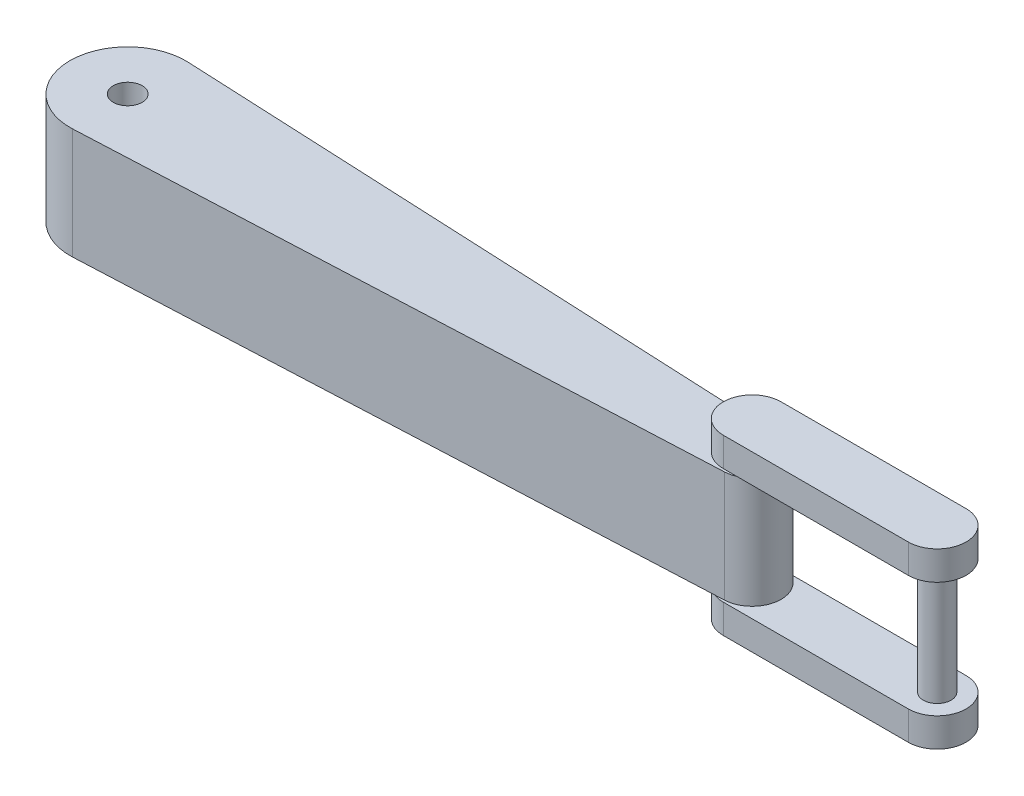
ISO-10303-21;
HEADER;
FILE_DESCRIPTION(('STEP AP214'),'2;1');
FILE_NAME('part.step','',(''),(''),'','','');
FILE_SCHEMA(('AUTOMOTIVE_DESIGN { 1 0 10303 214 1 1 1 1 }'));
ENDSEC;
DATA;
#1=APPLICATION_CONTEXT('core data for automotive mechanical design processes');
#2=APPLICATION_PROTOCOL_DEFINITION('international standard','automotive_design',2000,#1);
#3=PRODUCT_CONTEXT('',#1,'mechanical');
#4=PRODUCT('Part','Part','',(#3));
#5=PRODUCT_RELATED_PRODUCT_CATEGORY('part','',(#4));
#6=PRODUCT_DEFINITION_FORMATION('','',#4);
#7=PRODUCT_DEFINITION_CONTEXT('part definition',#1,'design');
#8=PRODUCT_DEFINITION('design','',#6,#7);
#9=PRODUCT_DEFINITION_SHAPE('','',#8);
#10=(LENGTH_UNIT() NAMED_UNIT(*) SI_UNIT(.MILLI.,.METRE.));
#11=(NAMED_UNIT(*) PLANE_ANGLE_UNIT() SI_UNIT($,.RADIAN.));
#12=(NAMED_UNIT(*) SI_UNIT($,.STERADIAN.) SOLID_ANGLE_UNIT());
#13=UNCERTAINTY_MEASURE_WITH_UNIT(LENGTH_MEASURE(1.E-05),#10,'distance_accuracy_value','');
#14=(GEOMETRIC_REPRESENTATION_CONTEXT(3) GLOBAL_UNCERTAINTY_ASSIGNED_CONTEXT((#13)) GLOBAL_UNIT_ASSIGNED_CONTEXT((#10,
#11,#12)) REPRESENTATION_CONTEXT('',''));
#15=CARTESIAN_POINT('',(0.,0.,0.));
#16=DIRECTION('',(0.,0.,1.));
#17=DIRECTION('',(1.,0.,0.));
#18=AXIS2_PLACEMENT_3D('',#15,#16,#17);
#19=CARTESIAN_POINT('',(270.,30.,0.));
#20=DIRECTION('',(0.,-1.,0.));
#21=DIRECTION('',(0.,0.,-1.));
#22=AXIS2_PLACEMENT_3D('',#19,#20,#21);
#23=CYLINDRICAL_SURFACE('',#22,4.99999999999999);
#24=CARTESIAN_POINT('',(270.,-24.,0.));
#25=DIRECTION('',(0.,1.,0.));
#26=DIRECTION('',(0.,0.,1.));
#27=AXIS2_PLACEMENT_3D('',#24,#25,#26);
#28=CIRCLE('',#27,4.99999999999999);
#29=CARTESIAN_POINT('',(270.,-24.,4.99999999999999));
#30=VERTEX_POINT('',#29);
#31=EDGE_CURVE('E232',#30,#30,#28,.T.);
#32=ORIENTED_EDGE('',*,*,#31,.F.);
#33=EDGE_LOOP('',(#32));
#34=FACE_BOUND('',#33,.T.);
#35=CARTESIAN_POINT('',(270.,-25.,0.));
#36=DIRECTION('',(0.,-1.,0.));
#37=DIRECTION('',(0.,0.,-1.));
#38=AXIS2_PLACEMENT_3D('',#35,#36,#37);
#39=CIRCLE('',#38,4.99999999999999);
#40=CARTESIAN_POINT('',(270.,-25.,-4.99999999999999));
#41=VERTEX_POINT('',#40);
#42=EDGE_CURVE('E144',#41,#41,#39,.F.);
#43=ORIENTED_EDGE('',*,*,#42,.T.);
#44=EDGE_LOOP('',(#43));
#45=FACE_BOUND('',#44,.T.);
#46=ADVANCED_FACE('F39',(#34,#45),#23,.T.);
#47=CARTESIAN_POINT('',(270.,24.,0.));
#48=DIRECTION('',(0.,1.,0.));
#49=DIRECTION('',(0.,0.,1.));
#50=AXIS2_PLACEMENT_3D('',#47,#48,#49);
#51=CIRCLE('',#50,4.99999999999999);
#52=CARTESIAN_POINT('',(270.,24.,4.99999999999999));
#53=VERTEX_POINT('',#52);
#54=EDGE_CURVE('E11',#53,#53,#51,.T.);
#55=ORIENTED_EDGE('',*,*,#54,.T.);
#56=EDGE_LOOP('',(#55));
#57=FACE_BOUND('',#56,.T.);
#58=CARTESIAN_POINT('',(270.,25.,0.));
#59=DIRECTION('',(0.,1.,0.));
#60=DIRECTION('',(0.,0.,1.));
#61=AXIS2_PLACEMENT_3D('',#58,#59,#60);
#62=CIRCLE('',#61,4.99999999999999);
#63=CARTESIAN_POINT('',(270.,25.,4.99999999999999));
#64=VERTEX_POINT('',#63);
#65=EDGE_CURVE('E231',#64,#64,#62,.F.);
#66=ORIENTED_EDGE('',*,*,#65,.T.);
#67=EDGE_LOOP('',(#66));
#68=FACE_BOUND('',#67,.T.);
#69=ADVANCED_FACE('F311',(#57,#68),#23,.T.);
#70=CARTESIAN_POINT('',(270.,-24.,0.));
#71=DIRECTION('',(0.,1.,0.));
#72=DIRECTION('',(0.,0.,1.));
#73=AXIS2_PLACEMENT_3D('',#70,#71,#72);
#74=CYLINDRICAL_SURFACE('',#73,12.5);
#75=DIRECTION('',(0.,1.,0.));
#76=VECTOR('',#75,1.);
#77=CARTESIAN_POINT('',(270.578703703704,-24.,-12.4865968952041));
#78=LINE('',#77,#76);
#79=CARTESIAN_POINT('',(270.578703703704,-24.,-12.4865968952041));
#80=VERTEX_POINT('',#79);
#81=CARTESIAN_POINT('',(270.578703703704,24.,-12.4865968952041));
#82=VERTEX_POINT('',#81);
#83=EDGE_CURVE('E273',#80,#82,#78,.T.);
#84=ORIENTED_EDGE('',*,*,#83,.T.);
#85=CARTESIAN_POINT('',(270.,24.,0.));
#86=DIRECTION('',(0.,1.,0.));
#87=DIRECTION('',(0.,0.,1.));
#88=AXIS2_PLACEMENT_3D('',#85,#86,#87);
#89=CIRCLE('',#88,12.5);
#90=CARTESIAN_POINT('',(270.578703703704,24.,12.4865968952041));
#91=VERTEX_POINT('',#90);
#92=EDGE_CURVE('E240',#91,#82,#89,.T.);
#93=ORIENTED_EDGE('',*,*,#92,.F.);
#94=DIRECTION('',(0.,1.,0.));
#95=VECTOR('',#94,1.);
#96=CARTESIAN_POINT('',(270.578703703704,-24.,12.4865968952041));
#97=LINE('',#96,#95);
#98=CARTESIAN_POINT('',(270.578703703704,-24.,12.4865968952041));
#99=VERTEX_POINT('',#98);
#100=EDGE_CURVE('E49',#99,#91,#97,.T.);
#101=ORIENTED_EDGE('',*,*,#100,.F.);
#102=CARTESIAN_POINT('',(270.,-24.,0.));
#103=DIRECTION('',(0.,1.,0.));
#104=DIRECTION('',(0.,0.,1.));
#105=AXIS2_PLACEMENT_3D('',#102,#103,#104);
#106=CIRCLE('',#105,12.5);
#107=EDGE_CURVE('E260',#99,#80,#106,.T.);
#108=ORIENTED_EDGE('',*,*,#107,.T.);
#109=EDGE_LOOP('',(#84,#93,#101,#108));
#110=FACE_BOUND('',#109,.T.);
#111=ADVANCED_FACE('F41',(#110),#74,.T.);
#112=CARTESIAN_POINT('',(270.578703703704,-24.,12.4865968952041));
#113=DIRECTION('',(0.0462962962962963,0.,0.998927751616325));
#114=DIRECTION('',(0.998927751616325,0.,-0.0462962962962963));
#115=AXIS2_PLACEMENT_3D('',#112,#113,#114);
#116=PLANE('',#115);
#117=ORIENTED_EDGE('',*,*,#100,.T.);
#118=DIRECTION('',(0.998927751616325,0.,-0.0462962962962963));
#119=VECTOR('',#118,1.);
#120=CARTESIAN_POINT('',(270.578703703704,24.,12.4865968952041));
#121=LINE('',#120,#119);
#122=CARTESIAN_POINT('',(1.15740740740741,24.,24.9731937904081));
#123=VERTEX_POINT('',#122);
#124=EDGE_CURVE('E252',#123,#91,#121,.T.);
#125=ORIENTED_EDGE('',*,*,#124,.F.);
#126=DIRECTION('',(0.,1.,0.));
#127=VECTOR('',#126,1.);
#128=CARTESIAN_POINT('',(1.15740740740741,-24.,24.9731937904081));
#129=LINE('',#128,#127);
#130=CARTESIAN_POINT('',(1.15740740740741,-24.,24.9731937904081));
#131=VERTEX_POINT('',#130);
#132=EDGE_CURVE('E64',#131,#123,#129,.T.);
#133=ORIENTED_EDGE('',*,*,#132,.F.);
#134=DIRECTION('',(0.998927751616325,0.,-0.0462962962962963));
#135=VECTOR('',#134,1.);
#136=CARTESIAN_POINT('',(270.578703703704,-24.,12.4865968952041));
#137=LINE('',#136,#135);
#138=EDGE_CURVE('E270',#131,#99,#137,.T.);
#139=ORIENTED_EDGE('',*,*,#138,.T.);
#140=EDGE_LOOP('',(#117,#125,#133,#139));
#141=FACE_BOUND('',#140,.T.);
#142=ADVANCED_FACE('F336',(#141),#116,.T.);
#143=CARTESIAN_POINT('',(0.,-24.,0.));
#144=DIRECTION('',(0.,1.,0.));
#145=DIRECTION('',(0.,0.,1.));
#146=AXIS2_PLACEMENT_3D('',#143,#144,#145);
#147=CYLINDRICAL_SURFACE('',#146,25.);
#148=ORIENTED_EDGE('',*,*,#132,.T.);
#149=CARTESIAN_POINT('',(0.,24.,0.));
#150=DIRECTION('',(0.,1.,0.));
#151=DIRECTION('',(0.,0.,1.));
#152=AXIS2_PLACEMENT_3D('',#149,#150,#151);
#153=CIRCLE('',#152,25.);
#154=CARTESIAN_POINT('',(1.15740740740741,24.,-24.9731937904081));
#155=VERTEX_POINT('',#154);
#156=EDGE_CURVE('E248',#155,#123,#153,.T.);
#157=ORIENTED_EDGE('',*,*,#156,.F.);
#158=DIRECTION('',(0.,1.,0.));
#159=VECTOR('',#158,1.);
#160=CARTESIAN_POINT('',(1.15740740740741,-24.,-24.9731937904081));
#161=LINE('',#160,#159);
#162=CARTESIAN_POINT('',(1.15740740740741,-24.,-24.9731937904081));
#163=VERTEX_POINT('',#162);
#164=EDGE_CURVE('E278',#163,#155,#161,.T.);
#165=ORIENTED_EDGE('',*,*,#164,.F.);
#166=CARTESIAN_POINT('',(0.,-24.,0.));
#167=DIRECTION('',(0.,1.,0.));
#168=DIRECTION('',(0.,0.,1.));
#169=AXIS2_PLACEMENT_3D('',#166,#167,#168);
#170=CIRCLE('',#169,25.);
#171=EDGE_CURVE('E267',#163,#131,#170,.T.);
#172=ORIENTED_EDGE('',*,*,#171,.T.);
#173=EDGE_LOOP('',(#148,#157,#165,#172));
#174=FACE_BOUND('',#173,.T.);
#175=ADVANCED_FACE('F339',(#174),#147,.T.);
#176=CARTESIAN_POINT('',(270.578703703704,-24.,-12.4865968952041));
#177=DIRECTION('',(0.0462962962962963,0.,-0.998927751616325));
#178=DIRECTION('',(-0.998927751616325,0.,-0.0462962962962963));
#179=AXIS2_PLACEMENT_3D('',#176,#177,#178);
#180=PLANE('',#179);
#181=ORIENTED_EDGE('',*,*,#164,.T.);
#182=DIRECTION('',(-0.998927751616325,0.,-0.0462962962962963));
#183=VECTOR('',#182,1.);
#184=CARTESIAN_POINT('',(270.578703703704,24.,-12.4865968952041));
#185=LINE('',#184,#183);
#186=EDGE_CURVE('E244',#82,#155,#185,.T.);
#187=ORIENTED_EDGE('',*,*,#186,.F.);
#188=ORIENTED_EDGE('',*,*,#83,.F.);
#189=DIRECTION('',(-0.998927751616325,0.,-0.0462962962962963));
#190=VECTOR('',#189,1.);
#191=CARTESIAN_POINT('',(270.578703703704,-24.,-12.4865968952041));
#192=LINE('',#191,#190);
#193=EDGE_CURVE('E263',#80,#163,#192,.T.);
#194=ORIENTED_EDGE('',*,*,#193,.T.);
#195=EDGE_LOOP('',(#181,#187,#188,#194));
#196=FACE_BOUND('',#195,.T.);
#197=ADVANCED_FACE('F334',(#196),#180,.T.);
#198=CARTESIAN_POINT('',(270.,-24.,0.));
#199=DIRECTION('',(0.,1.,0.));
#200=DIRECTION('',(0.,0.,1.));
#201=AXIS2_PLACEMENT_3D('',#198,#199,#200);
#202=PLANE('',#201);
#203=ORIENTED_EDGE('',*,*,#31,.T.);
#204=EDGE_LOOP('',(#203));
#205=FACE_BOUND('',#204,.T.);
#206=CARTESIAN_POINT('',(0.,-24.,0.));
#207=DIRECTION('',(0.,1.,0.));
#208=DIRECTION('',(0.,0.,1.));
#209=AXIS2_PLACEMENT_3D('',#206,#207,#208);
#210=CIRCLE('',#209,6.25);
#211=CARTESIAN_POINT('',(0.,-24.,6.25));
#212=VERTEX_POINT('',#211);
#213=EDGE_CURVE('E256',#212,#212,#210,.T.);
#214=ORIENTED_EDGE('',*,*,#213,.T.);
#215=EDGE_LOOP('',(#214));
#216=FACE_BOUND('',#215,.T.);
#217=ORIENTED_EDGE('',*,*,#107,.F.);
#218=ORIENTED_EDGE('',*,*,#138,.F.);
#219=ORIENTED_EDGE('',*,*,#171,.F.);
#220=ORIENTED_EDGE('',*,*,#193,.F.);
#221=EDGE_LOOP('',(#217,#218,#219,#220));
#222=FACE_BOUND('',#221,.T.);
#223=ADVANCED_FACE('F330',(#205,#216,#222),#202,.F.);
#224=CARTESIAN_POINT('',(0.,-24.,0.));
#225=DIRECTION('',(0.,1.,0.));
#226=DIRECTION('',(0.,0.,1.));
#227=AXIS2_PLACEMENT_3D('',#224,#225,#226);
#228=CYLINDRICAL_SURFACE('',#227,6.25);
#229=ORIENTED_EDGE('',*,*,#213,.F.);
#230=EDGE_LOOP('',(#229));
#231=FACE_BOUND('',#230,.T.);
#232=CARTESIAN_POINT('',(0.,24.,0.));
#233=DIRECTION('',(0.,1.,0.));
#234=DIRECTION('',(0.,0.,1.));
#235=AXIS2_PLACEMENT_3D('',#232,#233,#234);
#236=CIRCLE('',#235,6.25);
#237=CARTESIAN_POINT('',(0.,24.,6.25));
#238=VERTEX_POINT('',#237);
#239=EDGE_CURVE('E236',#238,#238,#236,.T.);
#240=ORIENTED_EDGE('',*,*,#239,.T.);
#241=EDGE_LOOP('',(#240));
#242=FACE_BOUND('',#241,.T.);
#243=ADVANCED_FACE('F326',(#231,#242),#228,.F.);
#244=CARTESIAN_POINT('',(270.,24.,0.));
#245=DIRECTION('',(0.,1.,0.));
#246=DIRECTION('',(0.,0.,1.));
#247=AXIS2_PLACEMENT_3D('',#244,#245,#246);
#248=PLANE('',#247);
#249=ORIENTED_EDGE('',*,*,#54,.F.);
#250=EDGE_LOOP('',(#249));
#251=FACE_BOUND('',#250,.T.);
#252=ORIENTED_EDGE('',*,*,#92,.T.);
#253=ORIENTED_EDGE('',*,*,#186,.T.);
#254=ORIENTED_EDGE('',*,*,#156,.T.);
#255=ORIENTED_EDGE('',*,*,#124,.T.);
#256=EDGE_LOOP('',(#252,#253,#254,#255));
#257=FACE_BOUND('',#256,.T.);
#258=ORIENTED_EDGE('',*,*,#239,.F.);
#259=EDGE_LOOP('',(#258));
#260=FACE_BOUND('',#259,.T.);
#261=ADVANCED_FACE('F323',(#251,#257,#260),#248,.T.);
#262=CARTESIAN_POINT('',(270.,37.5,0.));
#263=DIRECTION('',(0.,-1.,0.));
#264=DIRECTION('',(0.,0.,-1.));
#265=AXIS2_PLACEMENT_3D('',#262,#263,#264);
#266=CYLINDRICAL_SURFACE('',#265,12.5);
#267=CARTESIAN_POINT('',(270.,25.,0.));
#268=DIRECTION('',(0.,1.,0.));
#269=DIRECTION('',(0.,0.,1.));
#270=AXIS2_PLACEMENT_3D('',#267,#268,#269);
#271=CIRCLE('',#270,12.5);
#272=CARTESIAN_POINT('',(270.,25.,-12.5));
#273=VERTEX_POINT('',#272);
#274=CARTESIAN_POINT('',(270.,25.,12.5));
#275=VERTEX_POINT('',#274);
#276=EDGE_CURVE('E204',#273,#275,#271,.T.);
#277=ORIENTED_EDGE('',*,*,#276,.T.);
#278=DIRECTION('',(0.,-1.,0.));
#279=VECTOR('',#278,1.);
#280=CARTESIAN_POINT('',(270.,37.5,12.5));
#281=LINE('',#280,#279);
#282=CARTESIAN_POINT('',(270.,37.5,12.5));
#283=VERTEX_POINT('',#282);
#284=EDGE_CURVE('E227',#283,#275,#281,.T.);
#285=ORIENTED_EDGE('',*,*,#284,.F.);
#286=CARTESIAN_POINT('',(270.,37.5,0.));
#287=DIRECTION('',(0.,1.,0.));
#288=DIRECTION('',(0.,0.,1.));
#289=AXIS2_PLACEMENT_3D('',#286,#287,#288);
#290=CIRCLE('',#289,12.5);
#291=CARTESIAN_POINT('',(270.,37.5,-12.5));
#292=VERTEX_POINT('',#291);
#293=EDGE_CURVE('E189',#292,#283,#290,.T.);
#294=ORIENTED_EDGE('',*,*,#293,.F.);
#295=DIRECTION('',(0.,-1.,0.));
#296=VECTOR('',#295,1.);
#297=CARTESIAN_POINT('',(270.,37.5,-12.5));
#298=LINE('',#297,#296);
#299=EDGE_CURVE('E203',#292,#273,#298,.T.);
#300=ORIENTED_EDGE('',*,*,#299,.T.);
#301=EDGE_LOOP('',(#277,#285,#294,#300));
#302=FACE_BOUND('',#301,.T.);
#303=ADVANCED_FACE('F321',(#302),#266,.T.);
#304=CARTESIAN_POINT('',(270.,37.5,12.5));
#305=DIRECTION('',(0.,0.,-1.));
#306=DIRECTION('',(-1.,0.,0.));
#307=AXIS2_PLACEMENT_3D('',#304,#305,#306);
#308=PLANE('',#307);
#309=DIRECTION('',(1.,0.,0.));
#310=VECTOR('',#309,1.);
#311=CARTESIAN_POINT('',(270.,25.,12.5));
#312=LINE('',#311,#310);
#313=CARTESIAN_POINT('',(350.,25.,12.5));
#314=VERTEX_POINT('',#313);
#315=EDGE_CURVE('E208',#275,#314,#312,.T.);
#316=ORIENTED_EDGE('',*,*,#315,.T.);
#317=DIRECTION('',(0.,-1.,0.));
#318=VECTOR('',#317,1.);
#319=CARTESIAN_POINT('',(350.,37.5,12.5));
#320=LINE('',#319,#318);
#321=CARTESIAN_POINT('',(350.,37.5,12.5));
#322=VERTEX_POINT('',#321);
#323=EDGE_CURVE('E223',#322,#314,#320,.T.);
#324=ORIENTED_EDGE('',*,*,#323,.F.);
#325=DIRECTION('',(1.,0.,0.));
#326=VECTOR('',#325,1.);
#327=CARTESIAN_POINT('',(270.,37.5,12.5));
#328=LINE('',#327,#326);
#329=EDGE_CURVE('E193',#283,#322,#328,.T.);
#330=ORIENTED_EDGE('',*,*,#329,.F.);
#331=ORIENTED_EDGE('',*,*,#284,.T.);
#332=EDGE_LOOP('',(#316,#324,#330,#331));
#333=FACE_BOUND('',#332,.T.);
#334=ADVANCED_FACE('F404',(#333),#308,.F.);
#335=CARTESIAN_POINT('',(350.,37.5,0.));
#336=DIRECTION('',(0.,-1.,0.));
#337=DIRECTION('',(0.,0.,-1.));
#338=AXIS2_PLACEMENT_3D('',#335,#336,#337);
#339=CYLINDRICAL_SURFACE('',#338,12.5);
#340=CARTESIAN_POINT('',(350.,25.,0.));
#341=DIRECTION('',(0.,1.,0.));
#342=DIRECTION('',(0.,0.,1.));
#343=AXIS2_PLACEMENT_3D('',#340,#341,#342);
#344=CIRCLE('',#343,12.5);
#345=CARTESIAN_POINT('',(350.,25.,-12.5));
#346=VERTEX_POINT('',#345);
#347=EDGE_CURVE('E211',#314,#346,#344,.T.);
#348=ORIENTED_EDGE('',*,*,#347,.T.);
#349=DIRECTION('',(0.,-1.,0.));
#350=VECTOR('',#349,1.);
#351=CARTESIAN_POINT('',(350.,37.5,-12.5));
#352=LINE('',#351,#350);
#353=CARTESIAN_POINT('',(350.,37.5,-12.5));
#354=VERTEX_POINT('',#353);
#355=EDGE_CURVE('E219',#354,#346,#352,.T.);
#356=ORIENTED_EDGE('',*,*,#355,.F.);
#357=CARTESIAN_POINT('',(350.,37.5,0.));
#358=DIRECTION('',(0.,1.,0.));
#359=DIRECTION('',(0.,0.,1.));
#360=AXIS2_PLACEMENT_3D('',#357,#358,#359);
#361=CIRCLE('',#360,12.5);
#362=EDGE_CURVE('E197',#322,#354,#361,.T.);
#363=ORIENTED_EDGE('',*,*,#362,.F.);
#364=ORIENTED_EDGE('',*,*,#323,.T.);
#365=EDGE_LOOP('',(#348,#356,#363,#364));
#366=FACE_BOUND('',#365,.T.);
#367=ADVANCED_FACE('F413',(#366),#339,.T.);
#368=CARTESIAN_POINT('',(270.,37.5,-12.5));
#369=DIRECTION('',(0.,0.,1.));
#370=DIRECTION('',(1.,0.,0.));
#371=AXIS2_PLACEMENT_3D('',#368,#369,#370);
#372=PLANE('',#371);
#373=DIRECTION('',(-1.,0.,0.));
#374=VECTOR('',#373,1.);
#375=CARTESIAN_POINT('',(270.,25.,-12.5));
#376=LINE('',#375,#374);
#377=EDGE_CURVE('E194',#346,#273,#376,.T.);
#378=ORIENTED_EDGE('',*,*,#377,.T.);
#379=ORIENTED_EDGE('',*,*,#299,.F.);
#380=DIRECTION('',(-1.,0.,0.));
#381=VECTOR('',#380,1.);
#382=CARTESIAN_POINT('',(270.,37.5,-12.5));
#383=LINE('',#382,#381);
#384=EDGE_CURVE('E200',#354,#292,#383,.T.);
#385=ORIENTED_EDGE('',*,*,#384,.F.);
#386=ORIENTED_EDGE('',*,*,#355,.T.);
#387=EDGE_LOOP('',(#378,#379,#385,#386));
#388=FACE_BOUND('',#387,.T.);
#389=ADVANCED_FACE('F422',(#388),#372,.F.);
#390=CARTESIAN_POINT('',(270.,37.5,0.));
#391=DIRECTION('',(0.,1.,0.));
#392=DIRECTION('',(0.,0.,1.));
#393=AXIS2_PLACEMENT_3D('',#390,#391,#392);
#394=PLANE('',#393);
#395=ORIENTED_EDGE('',*,*,#293,.T.);
#396=ORIENTED_EDGE('',*,*,#329,.T.);
#397=ORIENTED_EDGE('',*,*,#362,.T.);
#398=ORIENTED_EDGE('',*,*,#384,.T.);
#399=EDGE_LOOP('',(#395,#396,#397,#398));
#400=FACE_BOUND('',#399,.T.);
#401=ADVANCED_FACE('F432',(#400),#394,.T.);
#402=CARTESIAN_POINT('',(270.,25.,0.));
#403=DIRECTION('',(0.,1.,0.));
#404=DIRECTION('',(0.,0.,1.));
#405=AXIS2_PLACEMENT_3D('',#402,#403,#404);
#406=PLANE('',#405);
#407=CARTESIAN_POINT('',(350.,25.,0.));
#408=DIRECTION('',(0.,1.,0.));
#409=DIRECTION('',(0.,0.,1.));
#410=AXIS2_PLACEMENT_3D('',#407,#408,#409);
#411=CIRCLE('',#410,5.99999999999999);
#412=CARTESIAN_POINT('',(350.,25.,5.99999999999999));
#413=VERTEX_POINT('',#412);
#414=EDGE_CURVE('E172',#413,#413,#411,.T.);
#415=ORIENTED_EDGE('',*,*,#414,.T.);
#416=EDGE_LOOP('',(#415));
#417=FACE_BOUND('',#416,.T.);
#418=ORIENTED_EDGE('',*,*,#65,.F.);
#419=EDGE_LOOP('',(#418));
#420=FACE_BOUND('',#419,.T.);
#421=ORIENTED_EDGE('',*,*,#276,.F.);
#422=ORIENTED_EDGE('',*,*,#377,.F.);
#423=ORIENTED_EDGE('',*,*,#347,.F.);
#424=ORIENTED_EDGE('',*,*,#315,.F.);
#425=EDGE_LOOP('',(#421,#422,#423,#424));
#426=FACE_BOUND('',#425,.T.);
#427=ADVANCED_FACE('F441',(#417,#420,#426),#406,.F.);
#428=CARTESIAN_POINT('',(270.,-37.5,0.));
#429=DIRECTION('',(0.,1.,0.));
#430=DIRECTION('',(0.,0.,1.));
#431=AXIS2_PLACEMENT_3D('',#428,#429,#430);
#432=CYLINDRICAL_SURFACE('',#431,12.5);
#433=CARTESIAN_POINT('',(270.,-25.,0.));
#434=DIRECTION('',(0.,1.,0.));
#435=DIRECTION('',(0.,0.,1.));
#436=AXIS2_PLACEMENT_3D('',#433,#434,#435);
#437=CIRCLE('',#436,12.5);
#438=CARTESIAN_POINT('',(270.,-25.,-12.5));
#439=VERTEX_POINT('',#438);
#440=CARTESIAN_POINT('',(270.,-25.,12.5));
#441=VERTEX_POINT('',#440);
#442=EDGE_CURVE('E138',#439,#441,#437,.T.);
#443=ORIENTED_EDGE('',*,*,#442,.F.);
#444=DIRECTION('',(0.,1.,0.));
#445=VECTOR('',#444,1.);
#446=CARTESIAN_POINT('',(270.,-37.5,-12.5));
#447=LINE('',#446,#445);
#448=CARTESIAN_POINT('',(270.,-37.5,-12.5));
#449=VERTEX_POINT('',#448);
#450=EDGE_CURVE('E132',#449,#439,#447,.T.);
#451=ORIENTED_EDGE('',*,*,#450,.F.);
#452=CARTESIAN_POINT('',(270.,-37.5,0.));
#453=DIRECTION('',(0.,1.,0.));
#454=DIRECTION('',(0.,0.,1.));
#455=AXIS2_PLACEMENT_3D('',#452,#453,#454);
#456=CIRCLE('',#455,12.5);
#457=CARTESIAN_POINT('',(270.,-37.5,12.5));
#458=VERTEX_POINT('',#457);
#459=EDGE_CURVE('E135',#449,#458,#456,.T.);
#460=ORIENTED_EDGE('',*,*,#459,.T.);
#461=DIRECTION('',(0.,1.,0.));
#462=VECTOR('',#461,1.);
#463=CARTESIAN_POINT('',(270.,-37.5,12.5));
#464=LINE('',#463,#462);
#465=EDGE_CURVE('E168',#458,#441,#464,.T.);
#466=ORIENTED_EDGE('',*,*,#465,.T.);
#467=EDGE_LOOP('',(#443,#451,#460,#466));
#468=FACE_BOUND('',#467,.T.);
#469=ADVANCED_FACE('F134',(#468),#432,.T.);
#470=CARTESIAN_POINT('',(270.,-37.5,-12.5));
#471=DIRECTION('',(0.,0.,-1.));
#472=DIRECTION('',(-1.,0.,0.));
#473=AXIS2_PLACEMENT_3D('',#470,#471,#472);
#474=PLANE('',#473);
#475=DIRECTION('',(-1.,0.,0.));
#476=VECTOR('',#475,1.);
#477=CARTESIAN_POINT('',(270.,-25.,-12.5));
#478=LINE('',#477,#476);
#479=CARTESIAN_POINT('',(350.,-25.,-12.5));
#480=VERTEX_POINT('',#479);
#481=EDGE_CURVE('E171',#480,#439,#478,.T.);
#482=ORIENTED_EDGE('',*,*,#481,.F.);
#483=DIRECTION('',(0.,1.,0.));
#484=VECTOR('',#483,1.);
#485=CARTESIAN_POINT('',(350.,-37.5,-12.5));
#486=LINE('',#485,#484);
#487=CARTESIAN_POINT('',(350.,-37.5,-12.5));
#488=VERTEX_POINT('',#487);
#489=EDGE_CURVE('E145',#488,#480,#486,.T.);
#490=ORIENTED_EDGE('',*,*,#489,.F.);
#491=DIRECTION('',(-1.,0.,0.));
#492=VECTOR('',#491,1.);
#493=CARTESIAN_POINT('',(270.,-37.5,-12.5));
#494=LINE('',#493,#492);
#495=EDGE_CURVE('E151',#488,#449,#494,.T.);
#496=ORIENTED_EDGE('',*,*,#495,.T.);
#497=ORIENTED_EDGE('',*,*,#450,.T.);
#498=EDGE_LOOP('',(#482,#490,#496,#497));
#499=FACE_BOUND('',#498,.T.);
#500=ADVANCED_FACE('F158',(#499),#474,.T.);
#501=CARTESIAN_POINT('',(350.,-37.5,0.));
#502=DIRECTION('',(0.,1.,0.));
#503=DIRECTION('',(0.,0.,1.));
#504=AXIS2_PLACEMENT_3D('',#501,#502,#503);
#505=CYLINDRICAL_SURFACE('',#504,12.5);
#506=CARTESIAN_POINT('',(350.,-25.,0.));
#507=DIRECTION('',(0.,1.,0.));
#508=DIRECTION('',(0.,0.,1.));
#509=AXIS2_PLACEMENT_3D('',#506,#507,#508);
#510=CIRCLE('',#509,12.5);
#511=CARTESIAN_POINT('',(350.,-25.,12.5));
#512=VERTEX_POINT('',#511);
#513=EDGE_CURVE('E175',#512,#480,#510,.T.);
#514=ORIENTED_EDGE('',*,*,#513,.F.);
#515=DIRECTION('',(0.,1.,0.));
#516=VECTOR('',#515,1.);
#517=CARTESIAN_POINT('',(350.,-37.5,12.5));
#518=LINE('',#517,#516);
#519=CARTESIAN_POINT('',(350.,-37.5,12.5));
#520=VERTEX_POINT('',#519);
#521=EDGE_CURVE('E184',#520,#512,#518,.T.);
#522=ORIENTED_EDGE('',*,*,#521,.F.);
#523=CARTESIAN_POINT('',(350.,-37.5,0.));
#524=DIRECTION('',(0.,1.,0.));
#525=DIRECTION('',(0.,0.,1.));
#526=AXIS2_PLACEMENT_3D('',#523,#524,#525);
#527=CIRCLE('',#526,12.5);
#528=EDGE_CURVE('E160',#520,#488,#527,.T.);
#529=ORIENTED_EDGE('',*,*,#528,.T.);
#530=ORIENTED_EDGE('',*,*,#489,.T.);
#531=EDGE_LOOP('',(#514,#522,#529,#530));
#532=FACE_BOUND('',#531,.T.);
#533=ADVANCED_FACE('F301',(#532),#505,.T.);
#534=CARTESIAN_POINT('',(270.,-37.5,12.5));
#535=DIRECTION('',(0.,0.,1.));
#536=DIRECTION('',(1.,0.,0.));
#537=AXIS2_PLACEMENT_3D('',#534,#535,#536);
#538=PLANE('',#537);
#539=DIRECTION('',(1.,0.,0.));
#540=VECTOR('',#539,1.);
#541=CARTESIAN_POINT('',(270.,-25.,12.5));
#542=LINE('',#541,#540);
#543=EDGE_CURVE('E156',#441,#512,#542,.T.);
#544=ORIENTED_EDGE('',*,*,#543,.F.);
#545=ORIENTED_EDGE('',*,*,#465,.F.);
#546=DIRECTION('',(1.,0.,0.));
#547=VECTOR('',#546,1.);
#548=CARTESIAN_POINT('',(270.,-37.5,12.5));
#549=LINE('',#548,#547);
#550=EDGE_CURVE('E154',#458,#520,#549,.T.);
#551=ORIENTED_EDGE('',*,*,#550,.T.);
#552=ORIENTED_EDGE('',*,*,#521,.T.);
#553=EDGE_LOOP('',(#544,#545,#551,#552));
#554=FACE_BOUND('',#553,.T.);
#555=ADVANCED_FACE('F298',(#554),#538,.T.);
#556=CARTESIAN_POINT('',(270.,-37.5,0.));
#557=DIRECTION('',(0.,-1.,0.));
#558=DIRECTION('',(0.,0.,1.));
#559=AXIS2_PLACEMENT_3D('',#556,#557,#558);
#560=PLANE('',#559);
#561=ORIENTED_EDGE('',*,*,#459,.F.);
#562=ORIENTED_EDGE('',*,*,#495,.F.);
#563=ORIENTED_EDGE('',*,*,#528,.F.);
#564=ORIENTED_EDGE('',*,*,#550,.F.);
#565=EDGE_LOOP('',(#561,#562,#563,#564));
#566=FACE_BOUND('',#565,.T.);
#567=ADVANCED_FACE('F149',(#566),#560,.T.);
#568=CARTESIAN_POINT('',(270.,-25.,0.));
#569=DIRECTION('',(0.,-1.,0.));
#570=DIRECTION('',(0.,0.,1.));
#571=AXIS2_PLACEMENT_3D('',#568,#569,#570);
#572=PLANE('',#571);
#573=CARTESIAN_POINT('',(350.,-25.,0.));
#574=DIRECTION('',(0.,-1.,0.));
#575=DIRECTION('',(0.,0.,-1.));
#576=AXIS2_PLACEMENT_3D('',#573,#574,#575);
#577=CIRCLE('',#576,5.99999999999999);
#578=CARTESIAN_POINT('',(350.,-25.,-5.99999999999999));
#579=VERTEX_POINT('',#578);
#580=EDGE_CURVE('E43',#579,#579,#577,.T.);
#581=ORIENTED_EDGE('',*,*,#580,.T.);
#582=EDGE_LOOP('',(#581));
#583=FACE_BOUND('',#582,.T.);
#584=ORIENTED_EDGE('',*,*,#42,.F.);
#585=EDGE_LOOP('',(#584));
#586=FACE_BOUND('',#585,.T.);
#587=ORIENTED_EDGE('',*,*,#442,.T.);
#588=ORIENTED_EDGE('',*,*,#543,.T.);
#589=ORIENTED_EDGE('',*,*,#513,.T.);
#590=ORIENTED_EDGE('',*,*,#481,.T.);
#591=EDGE_LOOP('',(#587,#588,#589,#590));
#592=FACE_BOUND('',#591,.T.);
#593=ADVANCED_FACE('F290',(#583,#586,#592),#572,.F.);
#594=CARTESIAN_POINT('',(350.,-30.,0.));
#595=DIRECTION('',(0.,1.,0.));
#596=DIRECTION('',(0.,0.,1.));
#597=AXIS2_PLACEMENT_3D('',#594,#595,#596);
#598=CYLINDRICAL_SURFACE('',#597,5.99999999999999);
#599=ORIENTED_EDGE('',*,*,#580,.F.);
#600=EDGE_LOOP('',(#599));
#601=FACE_BOUND('',#600,.T.);
#602=ORIENTED_EDGE('',*,*,#414,.F.);
#603=EDGE_LOOP('',(#602));
#604=FACE_BOUND('',#603,.T.);
#605=ADVANCED_FACE('F293',(#601,#604),#598,.T.);
#606=CLOSED_SHELL('',(#46,#69,#111,#142,#175,#197,#223,#243,#261,#303,#334,#367,#389,#401,#427,
#469,#500,#533,#555,#567,#593,#605));
#607=MANIFOLD_SOLID_BREP('B2',#606);
#608=ADVANCED_BREP_SHAPE_REPRESENTATION('',(#18,#607),#14);
#609=SHAPE_DEFINITION_REPRESENTATION(#9,#608);
ENDSEC;
END-ISO-10303-21;
